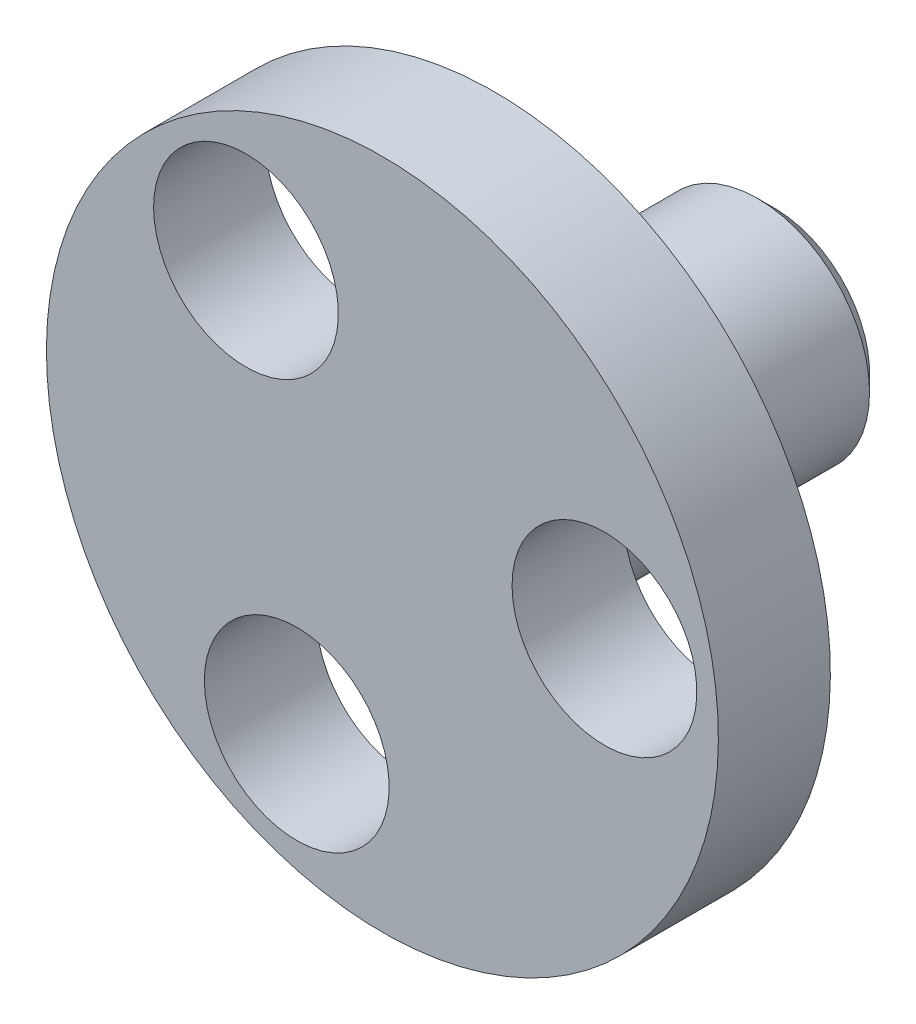
ISO-10303-21;
HEADER;
FILE_DESCRIPTION(('STEP AP214'),'2;1');
FILE_NAME('part.step','',(''),(''),'','','');
FILE_SCHEMA(('AUTOMOTIVE_DESIGN { 1 0 10303 214 1 1 1 1 }'));
ENDSEC;
DATA;
#1=APPLICATION_CONTEXT('core data for automotive mechanical design processes');
#2=APPLICATION_PROTOCOL_DEFINITION('international standard','automotive_design',2000,#1);
#3=PRODUCT_CONTEXT('',#1,'mechanical');
#4=PRODUCT('Part','Part','',(#3));
#5=PRODUCT_RELATED_PRODUCT_CATEGORY('part','',(#4));
#6=PRODUCT_DEFINITION_FORMATION('','',#4);
#7=PRODUCT_DEFINITION_CONTEXT('part definition',#1,'design');
#8=PRODUCT_DEFINITION('design','',#6,#7);
#9=PRODUCT_DEFINITION_SHAPE('','',#8);
#10=(LENGTH_UNIT() NAMED_UNIT(*) SI_UNIT(.MILLI.,.METRE.));
#11=(NAMED_UNIT(*) PLANE_ANGLE_UNIT() SI_UNIT($,.RADIAN.));
#12=(NAMED_UNIT(*) SI_UNIT($,.STERADIAN.) SOLID_ANGLE_UNIT());
#13=UNCERTAINTY_MEASURE_WITH_UNIT(LENGTH_MEASURE(1.E-05),#10,'distance_accuracy_value','');
#14=(GEOMETRIC_REPRESENTATION_CONTEXT(3) GLOBAL_UNCERTAINTY_ASSIGNED_CONTEXT((#13)) GLOBAL_UNIT_ASSIGNED_CONTEXT((#10,
#11,#12)) REPRESENTATION_CONTEXT('',''));
#15=CARTESIAN_POINT('',(0.,0.,0.));
#16=DIRECTION('',(0.,0.,1.));
#17=DIRECTION('',(1.,0.,0.));
#18=AXIS2_PLACEMENT_3D('',#15,#16,#17);
#19=CARTESIAN_POINT('',(0.,0.,-5.74999999998101));
#20=DIRECTION('',(0.,0.,-1.));
#21=DIRECTION('',(0.991393130780428,0.130918525203201,0.));
#22=AXIS2_PLACEMENT_3D('',#19,#20,#21);
#23=CYLINDRICAL_SURFACE('',#22,6.);
#24=CARTESIAN_POINT('',(0.,0.,-5.74999999998101));
#25=DIRECTION('',(0.,0.,1.));
#26=DIRECTION('',(0.991393130780428,0.130918525203201,0.));
#27=AXIS2_PLACEMENT_3D('',#24,#25,#26);
#28=CIRCLE('',#27,6.);
#29=CARTESIAN_POINT('',(5.94835878468257,0.785511151219206,-5.74999999998101));
#30=VERTEX_POINT('',#29);
#31=EDGE_CURVE('E32',#30,#30,#28,.T.);
#32=ORIENTED_EDGE('',*,*,#31,.F.);
#33=EDGE_LOOP('',(#32));
#34=FACE_BOUND('',#33,.T.);
#35=CARTESIAN_POINT('',(0.,0.,-7.74999999998101));
#36=DIRECTION('',(0.,0.,1.));
#37=DIRECTION('',(0.991393130780428,0.130918525203201,0.));
#38=AXIS2_PLACEMENT_3D('',#35,#36,#37);
#39=CIRCLE('',#38,6.);
#40=CARTESIAN_POINT('',(5.94835878468257,0.785511151219206,-7.74999999998101));
#41=VERTEX_POINT('',#40);
#42=EDGE_CURVE('E38',#41,#41,#39,.T.);
#43=ORIENTED_EDGE('',*,*,#42,.T.);
#44=EDGE_LOOP('',(#43));
#45=FACE_BOUND('',#44,.T.);
#46=ADVANCED_FACE('F15',(#34,#45),#23,.T.);
#47=CARTESIAN_POINT('',(0.,0.,-5.74999999998101));
#48=DIRECTION('',(0.,0.,1.));
#49=DIRECTION('',(-0.991393130780428,-0.130918525203201,0.));
#50=AXIS2_PLACEMENT_3D('',#47,#48,#49);
#51=PLANE('',#50);
#52=CARTESIAN_POINT('',(-1.529271186953,-3.69612359597936,-5.74999999998101));
#53=DIRECTION('',(0.,0.,1.));
#54=DIRECTION('',(-0.991393130780428,-0.130918525203201,0.));
#55=AXIS2_PLACEMENT_3D('',#52,#53,#54);
#56=CIRCLE('',#55,1.65);
#57=CARTESIAN_POINT('',(-3.16506985274071,-3.91213916256464,-5.74999999998101));
#58=VERTEX_POINT('',#57);
#59=EDGE_CURVE('E62',#58,#58,#56,.T.);
#60=ORIENTED_EDGE('',*,*,#59,.F.);
#61=EDGE_LOOP('',(#60));
#62=FACE_BOUND('',#61,.T.);
#63=CARTESIAN_POINT('',(-2.43630133616871,3.17244949516656,-5.74999999998101));
#64=DIRECTION('',(0.,0.,1.));
#65=DIRECTION('',(-0.991393130780428,-0.130918525203201,0.));
#66=AXIS2_PLACEMENT_3D('',#63,#64,#65);
#67=CIRCLE('',#66,1.65);
#68=CARTESIAN_POINT('',(-4.07210000195642,2.95643392858128,-5.74999999998101));
#69=VERTEX_POINT('',#68);
#70=EDGE_CURVE('E54',#69,#69,#67,.T.);
#71=ORIENTED_EDGE('',*,*,#70,.F.);
#72=EDGE_LOOP('',(#71));
#73=FACE_BOUND('',#72,.T.);
#74=CARTESIAN_POINT('',(3.96557252312171,0.523674100812805,-5.74999999998101));
#75=DIRECTION('',(0.,0.,1.));
#76=DIRECTION('',(-0.991393130780428,-0.130918525203201,0.));
#77=AXIS2_PLACEMENT_3D('',#74,#75,#76);
#78=CIRCLE('',#77,1.65);
#79=CARTESIAN_POINT('',(2.32977385733401,0.307658534227523,-5.74999999998101));
#80=VERTEX_POINT('',#79);
#81=EDGE_CURVE('E43',#80,#80,#78,.T.);
#82=ORIENTED_EDGE('',*,*,#81,.F.);
#83=EDGE_LOOP('',(#82));
#84=FACE_BOUND('',#83,.T.);
#85=ORIENTED_EDGE('',*,*,#31,.T.);
#86=EDGE_LOOP('',(#85));
#87=FACE_BOUND('',#86,.T.);
#88=ADVANCED_FACE('F89',(#62,#73,#84,#87),#51,.T.);
#89=CARTESIAN_POINT('',(0.,0.,-7.74999999998101));
#90=DIRECTION('',(0.,0.,1.));
#91=DIRECTION('',(-0.991393130780428,-0.130918525203201,0.));
#92=AXIS2_PLACEMENT_3D('',#89,#90,#91);
#93=PLANE('',#92);
#94=CARTESIAN_POINT('',(-1.529271186953,-3.69612359597936,-7.74999999998101));
#95=DIRECTION('',(0.,0.,1.));
#96=DIRECTION('',(-0.991393130780428,-0.130918525203201,0.));
#97=AXIS2_PLACEMENT_3D('',#94,#95,#96);
#98=CIRCLE('',#97,1.65);
#99=CARTESIAN_POINT('',(-3.16506985274071,-3.91213916256464,-7.74999999998101));
#100=VERTEX_POINT('',#99);
#101=EDGE_CURVE('E66',#100,#100,#98,.T.);
#102=ORIENTED_EDGE('',*,*,#101,.T.);
#103=EDGE_LOOP('',(#102));
#104=FACE_BOUND('',#103,.T.);
#105=CARTESIAN_POINT('',(-2.43630133616871,3.17244949516656,-7.74999999998101));
#106=DIRECTION('',(0.,0.,1.));
#107=DIRECTION('',(-0.991393130780428,-0.130918525203201,0.));
#108=AXIS2_PLACEMENT_3D('',#105,#106,#107);
#109=CIRCLE('',#108,1.65);
#110=CARTESIAN_POINT('',(-4.07210000195642,2.95643392858128,-7.74999999998101));
#111=VERTEX_POINT('',#110);
#112=EDGE_CURVE('E58',#111,#111,#109,.T.);
#113=ORIENTED_EDGE('',*,*,#112,.T.);
#114=EDGE_LOOP('',(#113));
#115=FACE_BOUND('',#114,.T.);
#116=CARTESIAN_POINT('',(0.,0.,-7.74999999998101));
#117=DIRECTION('',(0.,0.,1.));
#118=DIRECTION('',(0.991393130780428,0.130918525203201,0.));
#119=AXIS2_PLACEMENT_3D('',#116,#117,#118);
#120=CIRCLE('',#119,2.);
#121=CARTESIAN_POINT('',(1.98278626156086,0.261837050406402,-7.74999999998101));
#122=VERTEX_POINT('',#121);
#123=EDGE_CURVE('E51',#122,#122,#120,.T.);
#124=ORIENTED_EDGE('',*,*,#123,.T.);
#125=EDGE_LOOP('',(#124));
#126=FACE_BOUND('',#125,.T.);
#127=CARTESIAN_POINT('',(3.96557252312171,0.523674100812805,-7.74999999998101));
#128=DIRECTION('',(0.,0.,1.));
#129=DIRECTION('',(-0.991393130780428,-0.130918525203201,0.));
#130=AXIS2_PLACEMENT_3D('',#127,#128,#129);
#131=CIRCLE('',#130,1.65);
#132=CARTESIAN_POINT('',(2.32977385733401,0.307658534227523,-7.74999999998101));
#133=VERTEX_POINT('',#132);
#134=EDGE_CURVE('E48',#133,#133,#131,.T.);
#135=ORIENTED_EDGE('',*,*,#134,.T.);
#136=EDGE_LOOP('',(#135));
#137=FACE_BOUND('',#136,.T.);
#138=ORIENTED_EDGE('',*,*,#42,.F.);
#139=EDGE_LOOP('',(#138));
#140=FACE_BOUND('',#139,.T.);
#141=ADVANCED_FACE('F72',(#104,#115,#126,#137,#140),#93,.F.);
#142=CARTESIAN_POINT('',(3.96557252312171,0.523674100812805,-7.74999999998101));
#143=DIRECTION('',(0.,0.,1.));
#144=DIRECTION('',(-0.991393130780428,-0.130918525203201,0.));
#145=AXIS2_PLACEMENT_3D('',#142,#143,#144);
#146=CYLINDRICAL_SURFACE('',#145,1.65);
#147=ORIENTED_EDGE('',*,*,#81,.T.);
#148=EDGE_LOOP('',(#147));
#149=FACE_BOUND('',#148,.T.);
#150=ORIENTED_EDGE('',*,*,#134,.F.);
#151=EDGE_LOOP('',(#150));
#152=FACE_BOUND('',#151,.T.);
#153=ADVANCED_FACE('F103',(#149,#152),#146,.F.);
#154=CARTESIAN_POINT('',(0.,0.,-9.74999999998101));
#155=DIRECTION('',(0.,0.,1.));
#156=DIRECTION('',(-0.991393130780428,-0.130918525203201,0.));
#157=AXIS2_PLACEMENT_3D('',#154,#155,#156);
#158=CYLINDRICAL_SURFACE('',#157,2.);
#159=CARTESIAN_POINT('',(0.,0.,-12.449999999981));
#160=DIRECTION('',(0.,0.,1.));
#161=DIRECTION('',(-0.991393130780428,-0.130918525203201,0.));
#162=AXIS2_PLACEMENT_3D('',#159,#160,#161);
#163=CIRCLE('',#162,2.);
#164=CARTESIAN_POINT('',(-1.98278626156086,-0.261837050406402,-12.449999999981));
#165=VERTEX_POINT('',#164);
#166=EDGE_CURVE('E23',#165,#165,#163,.T.);
#167=ORIENTED_EDGE('',*,*,#166,.T.);
#168=EDGE_LOOP('',(#167));
#169=FACE_BOUND('',#168,.T.);
#170=ORIENTED_EDGE('',*,*,#123,.F.);
#171=EDGE_LOOP('',(#170));
#172=FACE_BOUND('',#171,.T.);
#173=ADVANCED_FACE('F100',(#169,#172),#158,.T.);
#174=CARTESIAN_POINT('',(0.,0.,-12.749999999981));
#175=DIRECTION('',(0.,0.,1.));
#176=DIRECTION('',(-0.991393130780428,-0.130918525203201,0.));
#177=AXIS2_PLACEMENT_3D('',#174,#175,#176);
#178=PLANE('',#177);
#179=CARTESIAN_POINT('',(0.,0.,-12.749999999981));
#180=DIRECTION('',(0.,0.,1.));
#181=DIRECTION('',(-0.991393130780428,-0.130918525203201,0.));
#182=AXIS2_PLACEMENT_3D('',#179,#180,#181);
#183=CIRCLE('',#182,1.7);
#184=CARTESIAN_POINT('',(-1.68536832232673,-0.222561492845442,-12.749999999981));
#185=VERTEX_POINT('',#184);
#186=EDGE_CURVE('E10',#185,#185,#183,.F.);
#187=ORIENTED_EDGE('',*,*,#186,.T.);
#188=EDGE_LOOP('',(#187));
#189=FACE_BOUND('',#188,.T.);
#190=ADVANCED_FACE('F85',(#189),#178,.F.);
#191=CARTESIAN_POINT('',(-2.43630133616871,3.17244949516656,-7.74999999998101));
#192=DIRECTION('',(0.,0.,1.));
#193=DIRECTION('',(-0.991393130780428,-0.130918525203201,0.));
#194=AXIS2_PLACEMENT_3D('',#191,#192,#193);
#195=CYLINDRICAL_SURFACE('',#194,1.65);
#196=ORIENTED_EDGE('',*,*,#70,.T.);
#197=EDGE_LOOP('',(#196));
#198=FACE_BOUND('',#197,.T.);
#199=ORIENTED_EDGE('',*,*,#112,.F.);
#200=EDGE_LOOP('',(#199));
#201=FACE_BOUND('',#200,.T.);
#202=ADVANCED_FACE('F77',(#198,#201),#195,.F.);
#203=CARTESIAN_POINT('',(-1.529271186953,-3.69612359597936,-7.74999999998101));
#204=DIRECTION('',(0.,0.,1.));
#205=DIRECTION('',(-0.991393130780428,-0.130918525203201,0.));
#206=AXIS2_PLACEMENT_3D('',#203,#204,#205);
#207=CYLINDRICAL_SURFACE('',#206,1.65);
#208=ORIENTED_EDGE('',*,*,#59,.T.);
#209=EDGE_LOOP('',(#208));
#210=FACE_BOUND('',#209,.T.);
#211=ORIENTED_EDGE('',*,*,#101,.F.);
#212=EDGE_LOOP('',(#211));
#213=FACE_BOUND('',#212,.T.);
#214=ADVANCED_FACE('F75',(#210,#213),#207,.F.);
#215=CARTESIAN_POINT('',(0.,0.,-12.449999999981));
#216=DIRECTION('',(0.,0.,1.));
#217=DIRECTION('',(-0.991393130780428,-0.130918525203201,0.));
#218=AXIS2_PLACEMENT_3D('',#215,#216,#217);
#219=CONICAL_SURFACE('',#218,2.,0.785398163397448);
#220=ORIENTED_EDGE('',*,*,#186,.F.);
#221=EDGE_LOOP('',(#220));
#222=FACE_BOUND('',#221,.T.);
#223=ORIENTED_EDGE('',*,*,#166,.F.);
#224=EDGE_LOOP('',(#223));
#225=FACE_BOUND('',#224,.T.);
#226=ADVANCED_FACE('F17',(#222,#225),#219,.T.);
#227=CLOSED_SHELL('',(#46,#88,#141,#153,#173,#190,#202,#214,#226));
#228=MANIFOLD_SOLID_BREP('B1',#227);
#229=ADVANCED_BREP_SHAPE_REPRESENTATION('',(#18,#228),#14);
#230=SHAPE_DEFINITION_REPRESENTATION(#9,#229);
ENDSEC;
END-ISO-10303-21;
